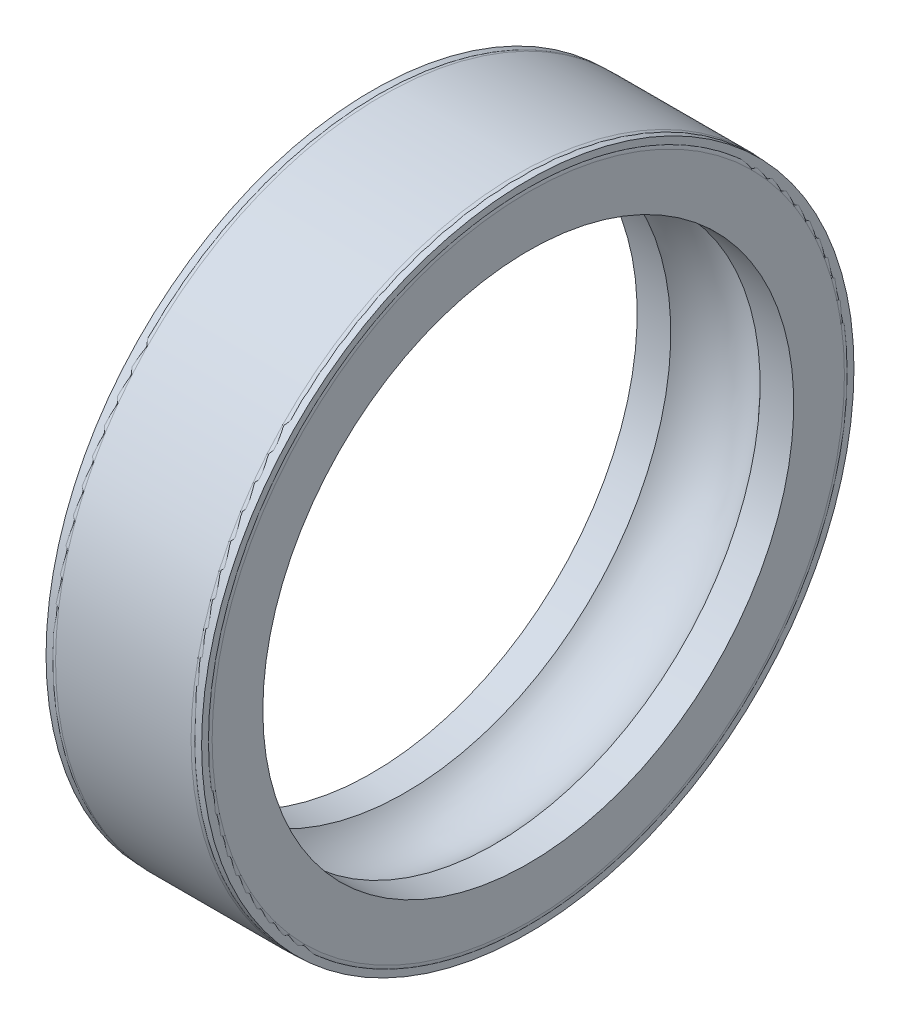
ISO-10303-21;
HEADER;
FILE_DESCRIPTION(('STEP AP214'),'2;1');
FILE_NAME('part.step','',(''),(''),'','','');
FILE_SCHEMA(('AUTOMOTIVE_DESIGN { 1 0 10303 214 1 1 1 1 }'));
ENDSEC;
DATA;
#1=APPLICATION_CONTEXT('core data for automotive mechanical design processes');
#2=APPLICATION_PROTOCOL_DEFINITION('international standard','automotive_design',2000,#1);
#3=PRODUCT_CONTEXT('',#1,'mechanical');
#4=PRODUCT('Part','Part','',(#3));
#5=PRODUCT_RELATED_PRODUCT_CATEGORY('part','',(#4));
#6=PRODUCT_DEFINITION_FORMATION('','',#4);
#7=PRODUCT_DEFINITION_CONTEXT('part definition',#1,'design');
#8=PRODUCT_DEFINITION('design','',#6,#7);
#9=PRODUCT_DEFINITION_SHAPE('','',#8);
#10=(LENGTH_UNIT() NAMED_UNIT(*) SI_UNIT(.MILLI.,.METRE.));
#11=(NAMED_UNIT(*) PLANE_ANGLE_UNIT() SI_UNIT($,.RADIAN.));
#12=(NAMED_UNIT(*) SI_UNIT($,.STERADIAN.) SOLID_ANGLE_UNIT());
#13=UNCERTAINTY_MEASURE_WITH_UNIT(LENGTH_MEASURE(1.E-05),#10,'distance_accuracy_value','');
#14=(GEOMETRIC_REPRESENTATION_CONTEXT(3) GLOBAL_UNCERTAINTY_ASSIGNED_CONTEXT((#13)) GLOBAL_UNIT_ASSIGNED_CONTEXT((#10,
#11,#12)) REPRESENTATION_CONTEXT('',''));
#15=CARTESIAN_POINT('',(0.,0.,0.));
#16=DIRECTION('',(0.,0.,1.));
#17=DIRECTION('',(1.,0.,0.));
#18=AXIS2_PLACEMENT_3D('',#15,#16,#17);
#19=CARTESIAN_POINT('',(-398.622618289716,0.,2.83198918325356));
#20=DIRECTION('',(-1.,0.,0.));
#21=DIRECTION('',(0.,0.,1.));
#22=AXIS2_PLACEMENT_3D('',#19,#20,#21);
#23=CYLINDRICAL_SURFACE('',#22,1343.66);
#24=CARTESIAN_POINT('',(-226.045729886676,0.,2.83198918325356));
#25=DIRECTION('',(-1.,0.,0.));
#26=DIRECTION('',(0.,0.,1.));
#27=AXIS2_PLACEMENT_3D('',#24,#25,#26);
#28=CIRCLE('',#27,1343.66);
#29=CARTESIAN_POINT('',(-226.045729886676,0.,1346.49198918325));
#30=VERTEX_POINT('',#29);
#31=EDGE_CURVE('E62',#30,#30,#28,.T.);
#32=ORIENTED_EDGE('',*,*,#31,.F.);
#33=EDGE_LOOP('',(#32));
#34=FACE_BOUND('',#33,.T.);
#35=CARTESIAN_POINT('',(-396.24,0.,2.83198918325356));
#36=DIRECTION('',(-1.,0.,0.));
#37=DIRECTION('',(0.,0.,1.));
#38=AXIS2_PLACEMENT_3D('',#35,#36,#37);
#39=CIRCLE('',#38,1343.66);
#40=CARTESIAN_POINT('',(-396.24,0.,1346.49198918325));
#41=VERTEX_POINT('',#40);
#42=EDGE_CURVE('E74',#41,#41,#39,.T.);
#43=ORIENTED_EDGE('',*,*,#42,.T.);
#44=EDGE_LOOP('',(#43));
#45=FACE_BOUND('',#44,.T.);
#46=ADVANCED_FACE('F38',(#34,#45),#23,.F.);
#47=CARTESIAN_POINT('',(0.,0.,2.83198918325356));
#48=DIRECTION('',(-1.,0.,0.));
#49=DIRECTION('',(0.,0.,1.));
#50=AXIS2_PLACEMENT_3D('',#47,#48,#49);
#51=TOROIDAL_SURFACE('',#50,1143.,302.26);
#52=CARTESIAN_POINT('',(226.045729886676,0.,2.83198918325356));
#53=DIRECTION('',(-1.,0.,0.));
#54=DIRECTION('',(0.,0.,1.));
#55=AXIS2_PLACEMENT_3D('',#52,#53,#54);
#56=CIRCLE('',#55,1343.66);
#57=CARTESIAN_POINT('',(226.045729886676,0.,1346.49198918325));
#58=VERTEX_POINT('',#57);
#59=EDGE_CURVE('E66',#58,#58,#56,.T.);
#60=ORIENTED_EDGE('',*,*,#59,.F.);
#61=EDGE_LOOP('',(#60));
#62=FACE_BOUND('',#61,.T.);
#63=ORIENTED_EDGE('',*,*,#31,.T.);
#64=EDGE_LOOP('',(#63));
#65=FACE_BOUND('',#64,.T.);
#66=ADVANCED_FACE('F136',(#62,#65),#51,.F.);
#67=CARTESIAN_POINT('',(-398.622618289716,0.,2.83198918325356));
#68=DIRECTION('',(-1.,0.,0.));
#69=DIRECTION('',(0.,0.,1.));
#70=AXIS2_PLACEMENT_3D('',#67,#68,#69);
#71=CYLINDRICAL_SURFACE('',#70,1343.66);
#72=CARTESIAN_POINT('',(396.24,0.,2.83198918325356));
#73=DIRECTION('',(-1.,0.,0.));
#74=DIRECTION('',(0.,0.,1.));
#75=AXIS2_PLACEMENT_3D('',#72,#73,#74);
#76=CIRCLE('',#75,1343.66);
#77=CARTESIAN_POINT('',(396.24,0.,1346.49198918325));
#78=VERTEX_POINT('',#77);
#79=EDGE_CURVE('E70',#78,#78,#76,.T.);
#80=ORIENTED_EDGE('',*,*,#79,.F.);
#81=EDGE_LOOP('',(#80));
#82=FACE_BOUND('',#81,.T.);
#83=ORIENTED_EDGE('',*,*,#59,.T.);
#84=EDGE_LOOP('',(#83));
#85=FACE_BOUND('',#84,.T.);
#86=ADVANCED_FACE('F133',(#82,#85),#71,.F.);
#87=CARTESIAN_POINT('',(396.24,0.,0.));
#88=DIRECTION('',(1.,0.,0.));
#89=DIRECTION('',(0.,0.,-1.));
#90=AXIS2_PLACEMENT_3D('',#87,#88,#89);
#91=PLANE('',#90);
#92=CARTESIAN_POINT('',(396.24,0.,2.83198918325356));
#93=DIRECTION('',(1.,0.,0.));
#94=DIRECTION('',(0.,0.,-1.));
#95=AXIS2_PLACEMENT_3D('',#92,#93,#94);
#96=CIRCLE('',#95,1600.2);
#97=CARTESIAN_POINT('',(396.24,0.,-1597.36801081675));
#98=VERTEX_POINT('',#97);
#99=EDGE_CURVE('E10',#98,#98,#96,.T.);
#100=ORIENTED_EDGE('',*,*,#99,.T.);
#101=EDGE_LOOP('',(#100));
#102=FACE_BOUND('',#101,.T.);
#103=ORIENTED_EDGE('',*,*,#79,.T.);
#104=EDGE_LOOP('',(#103));
#105=FACE_BOUND('',#104,.T.);
#106=ADVANCED_FACE('F130',(#102,#105),#91,.T.);
#107=CARTESIAN_POINT('',(-398.622618289716,0.,2.83198918325356));
#108=DIRECTION('',(-1.,0.,0.));
#109=DIRECTION('',(0.,0.,1.));
#110=AXIS2_PLACEMENT_3D('',#107,#108,#109);
#111=CYLINDRICAL_SURFACE('',#110,1653.54);
#112=CARTESIAN_POINT('',(-342.9,0.,2.83198918325356));
#113=DIRECTION('',(1.,0.,0.));
#114=DIRECTION('',(0.,0.,-1.));
#115=AXIS2_PLACEMENT_3D('',#112,#113,#114);
#116=CIRCLE('',#115,1653.54);
#117=CARTESIAN_POINT('',(-342.9,0.,-1650.70801081675));
#118=VERTEX_POINT('',#117);
#119=EDGE_CURVE('E46',#118,#118,#116,.T.);
#120=ORIENTED_EDGE('',*,*,#119,.T.);
#121=EDGE_LOOP('',(#120));
#122=FACE_BOUND('',#121,.T.);
#123=CARTESIAN_POINT('',(342.9,0.,2.83198918325356));
#124=DIRECTION('',(1.,0.,0.));
#125=DIRECTION('',(0.,0.,-1.));
#126=AXIS2_PLACEMENT_3D('',#123,#124,#125);
#127=CIRCLE('',#126,1653.54);
#128=CARTESIAN_POINT('',(342.9,0.,-1650.70801081675));
#129=VERTEX_POINT('',#128);
#130=EDGE_CURVE('E51',#129,#129,#127,.F.);
#131=ORIENTED_EDGE('',*,*,#130,.T.);
#132=EDGE_LOOP('',(#131));
#133=FACE_BOUND('',#132,.T.);
#134=ADVANCED_FACE('F126',(#122,#133),#111,.T.);
#135=CARTESIAN_POINT('',(-396.24,0.,0.));
#136=DIRECTION('',(1.,0.,0.));
#137=DIRECTION('',(0.,0.,-1.));
#138=AXIS2_PLACEMENT_3D('',#135,#136,#137);
#139=PLANE('',#138);
#140=CARTESIAN_POINT('',(-396.24,0.,2.83198918325356));
#141=DIRECTION('',(1.,0.,0.));
#142=DIRECTION('',(0.,0.,-1.));
#143=AXIS2_PLACEMENT_3D('',#140,#141,#142);
#144=CIRCLE('',#143,1600.2);
#145=CARTESIAN_POINT('',(-396.24,0.,-1597.36801081675));
#146=VERTEX_POINT('',#145);
#147=EDGE_CURVE('E56',#146,#146,#144,.F.);
#148=ORIENTED_EDGE('',*,*,#147,.T.);
#149=EDGE_LOOP('',(#148));
#150=FACE_BOUND('',#149,.T.);
#151=ORIENTED_EDGE('',*,*,#42,.F.);
#152=EDGE_LOOP('',(#151));
#153=FACE_BOUND('',#152,.T.);
#154=ADVANCED_FACE('F122',(#150,#153),#139,.F.);
#155=CARTESIAN_POINT('',(-342.9,0.,2.83198918325356));
#156=DIRECTION('',(1.,0.,0.));
#157=DIRECTION('',(0.,0.,-1.));
#158=AXIS2_PLACEMENT_3D('',#155,#156,#157);
#159=TOROIDAL_SURFACE('',#158,1600.2,53.34);
#160=ORIENTED_EDGE('',*,*,#119,.F.);
#161=EDGE_LOOP('',(#160));
#162=FACE_BOUND('',#161,.T.);
#163=ORIENTED_EDGE('',*,*,#147,.F.);
#164=EDGE_LOOP('',(#163));
#165=FACE_BOUND('',#164,.T.);
#166=ADVANCED_FACE('F125',(#162,#165),#159,.T.);
#167=CARTESIAN_POINT('',(342.9,0.,2.83198918325356));
#168=DIRECTION('',(1.,0.,0.));
#169=DIRECTION('',(0.,0.,-1.));
#170=AXIS2_PLACEMENT_3D('',#167,#168,#169);
#171=TOROIDAL_SURFACE('',#170,1600.2,53.34);
#172=ORIENTED_EDGE('',*,*,#99,.F.);
#173=EDGE_LOOP('',(#172));
#174=FACE_BOUND('',#173,.T.);
#175=ORIENTED_EDGE('',*,*,#130,.F.);
#176=EDGE_LOOP('',(#175));
#177=FACE_BOUND('',#176,.T.);
#178=ADVANCED_FACE('F40',(#174,#177),#171,.T.);
#179=CLOSED_SHELL('',(#46,#66,#86,#106,#134,#154,#166,#178));
#180=CARTESIAN_POINT('',(-398.622618289716,0.,2.83198918325356));
#181=DIRECTION('',(-1.,0.,0.));
#182=DIRECTION('',(0.,0.,1.));
#183=AXIS2_PLACEMENT_3D('',#180,#181,#182);
#184=CYLINDRICAL_SURFACE('',#183,1346.2);
#185=CARTESIAN_POINT('',(-227.184506513979,0.,2.83198918325356));
#186=DIRECTION('',(-1.,0.,0.));
#187=DIRECTION('',(0.,0.,1.));
#188=AXIS2_PLACEMENT_3D('',#185,#186,#187);
#189=CIRCLE('',#188,1346.2);
#190=CARTESIAN_POINT('',(-227.184506513979,0.,1349.03198918325));
#191=VERTEX_POINT('',#190);
#192=EDGE_CURVE('E78',#191,#191,#189,.T.);
#193=ORIENTED_EDGE('',*,*,#192,.T.);
#194=EDGE_LOOP('',(#193));
#195=FACE_BOUND('',#194,.T.);
#196=CARTESIAN_POINT('',(-393.7,0.,2.83198918325356));
#197=DIRECTION('',(-1.,0.,0.));
#198=DIRECTION('',(0.,0.,1.));
#199=AXIS2_PLACEMENT_3D('',#196,#197,#198);
#200=CIRCLE('',#199,1346.2);
#201=CARTESIAN_POINT('',(-393.7,0.,1349.03198918325));
#202=VERTEX_POINT('',#201);
#203=EDGE_CURVE('E98',#202,#202,#200,.T.);
#204=ORIENTED_EDGE('',*,*,#203,.F.);
#205=EDGE_LOOP('',(#204));
#206=FACE_BOUND('',#205,.T.);
#207=ADVANCED_FACE('F106',(#195,#206),#184,.T.);
#208=CARTESIAN_POINT('',(0.,0.,2.83198918325356));
#209=DIRECTION('',(-1.,0.,0.));
#210=DIRECTION('',(0.,0.,1.));
#211=AXIS2_PLACEMENT_3D('',#208,#209,#210);
#212=TOROIDAL_SURFACE('',#211,1143.,304.8);
#213=CARTESIAN_POINT('',(227.184506513979,0.,2.83198918325356));
#214=DIRECTION('',(-1.,0.,0.));
#215=DIRECTION('',(0.,0.,1.));
#216=AXIS2_PLACEMENT_3D('',#213,#214,#215);
#217=CIRCLE('',#216,1346.2);
#218=CARTESIAN_POINT('',(227.184506513979,0.,1349.03198918325));
#219=VERTEX_POINT('',#218);
#220=EDGE_CURVE('E82',#219,#219,#217,.T.);
#221=ORIENTED_EDGE('',*,*,#220,.T.);
#222=EDGE_LOOP('',(#221));
#223=FACE_BOUND('',#222,.T.);
#224=ORIENTED_EDGE('',*,*,#192,.F.);
#225=EDGE_LOOP('',(#224));
#226=FACE_BOUND('',#225,.T.);
#227=ADVANCED_FACE('F108',(#223,#226),#212,.T.);
#228=CARTESIAN_POINT('',(-398.622618289716,0.,2.83198918325356));
#229=DIRECTION('',(-1.,0.,0.));
#230=DIRECTION('',(0.,0.,1.));
#231=AXIS2_PLACEMENT_3D('',#228,#229,#230);
#232=CYLINDRICAL_SURFACE('',#231,1346.2);
#233=CARTESIAN_POINT('',(393.7,0.,2.83198918325356));
#234=DIRECTION('',(-1.,0.,0.));
#235=DIRECTION('',(0.,0.,1.));
#236=AXIS2_PLACEMENT_3D('',#233,#234,#235);
#237=CIRCLE('',#236,1346.2);
#238=CARTESIAN_POINT('',(393.7,0.,1349.03198918325));
#239=VERTEX_POINT('',#238);
#240=EDGE_CURVE('E86',#239,#239,#237,.T.);
#241=ORIENTED_EDGE('',*,*,#240,.T.);
#242=EDGE_LOOP('',(#241));
#243=FACE_BOUND('',#242,.T.);
#244=ORIENTED_EDGE('',*,*,#220,.F.);
#245=EDGE_LOOP('',(#244));
#246=FACE_BOUND('',#245,.T.);
#247=ADVANCED_FACE('F116',(#243,#246),#232,.T.);
#248=CARTESIAN_POINT('',(393.7,0.,0.));
#249=DIRECTION('',(1.,0.,0.));
#250=DIRECTION('',(0.,0.,-1.));
#251=AXIS2_PLACEMENT_3D('',#248,#249,#250);
#252=PLANE('',#251);
#253=ORIENTED_EDGE('',*,*,#240,.F.);
#254=EDGE_LOOP('',(#253));
#255=FACE_BOUND('',#254,.T.);
#256=CARTESIAN_POINT('',(393.7,0.,2.83198918325356));
#257=DIRECTION('',(-1.,0.,0.));
#258=DIRECTION('',(0.,0.,1.));
#259=AXIS2_PLACEMENT_3D('',#256,#257,#258);
#260=CIRCLE('',#259,1651.);
#261=CARTESIAN_POINT('',(393.7,0.,1653.83198918325));
#262=VERTEX_POINT('',#261);
#263=EDGE_CURVE('E90',#262,#262,#260,.T.);
#264=ORIENTED_EDGE('',*,*,#263,.T.);
#265=EDGE_LOOP('',(#264));
#266=FACE_BOUND('',#265,.T.);
#267=ADVANCED_FACE('F200',(#255,#266),#252,.F.);
#268=CARTESIAN_POINT('',(-398.622618289716,0.,2.83198918325356));
#269=DIRECTION('',(-1.,0.,0.));
#270=DIRECTION('',(0.,0.,1.));
#271=AXIS2_PLACEMENT_3D('',#268,#269,#270);
#272=CYLINDRICAL_SURFACE('',#271,1651.);
#273=ORIENTED_EDGE('',*,*,#263,.F.);
#274=EDGE_LOOP('',(#273));
#275=FACE_BOUND('',#274,.T.);
#276=CARTESIAN_POINT('',(-393.7,0.,2.83198918325356));
#277=DIRECTION('',(-1.,0.,0.));
#278=DIRECTION('',(0.,0.,1.));
#279=AXIS2_PLACEMENT_3D('',#276,#277,#278);
#280=CIRCLE('',#279,1651.);
#281=CARTESIAN_POINT('',(-393.7,0.,1653.83198918325));
#282=VERTEX_POINT('',#281);
#283=EDGE_CURVE('E94',#282,#282,#280,.T.);
#284=ORIENTED_EDGE('',*,*,#283,.T.);
#285=EDGE_LOOP('',(#284));
#286=FACE_BOUND('',#285,.T.);
#287=ADVANCED_FACE('F191',(#275,#286),#272,.F.);
#288=CARTESIAN_POINT('',(-393.7,0.,0.));
#289=DIRECTION('',(1.,0.,0.));
#290=DIRECTION('',(0.,0.,-1.));
#291=AXIS2_PLACEMENT_3D('',#288,#289,#290);
#292=PLANE('',#291);
#293=ORIENTED_EDGE('',*,*,#203,.T.);
#294=EDGE_LOOP('',(#293));
#295=FACE_BOUND('',#294,.T.);
#296=ORIENTED_EDGE('',*,*,#283,.F.);
#297=EDGE_LOOP('',(#296));
#298=FACE_BOUND('',#297,.T.);
#299=ADVANCED_FACE('F103',(#295,#298),#292,.T.);
#300=CLOSED_SHELL('',(#207,#227,#247,#267,#287,#299));
#301=ORIENTED_CLOSED_SHELL('',*,#300,.T.);
#302=BREP_WITH_VOIDS('B2',#179,(#301));
#303=ADVANCED_BREP_SHAPE_REPRESENTATION('',(#18,#302),#14);
#304=SHAPE_DEFINITION_REPRESENTATION(#9,#303);
ENDSEC;
END-ISO-10303-21;
